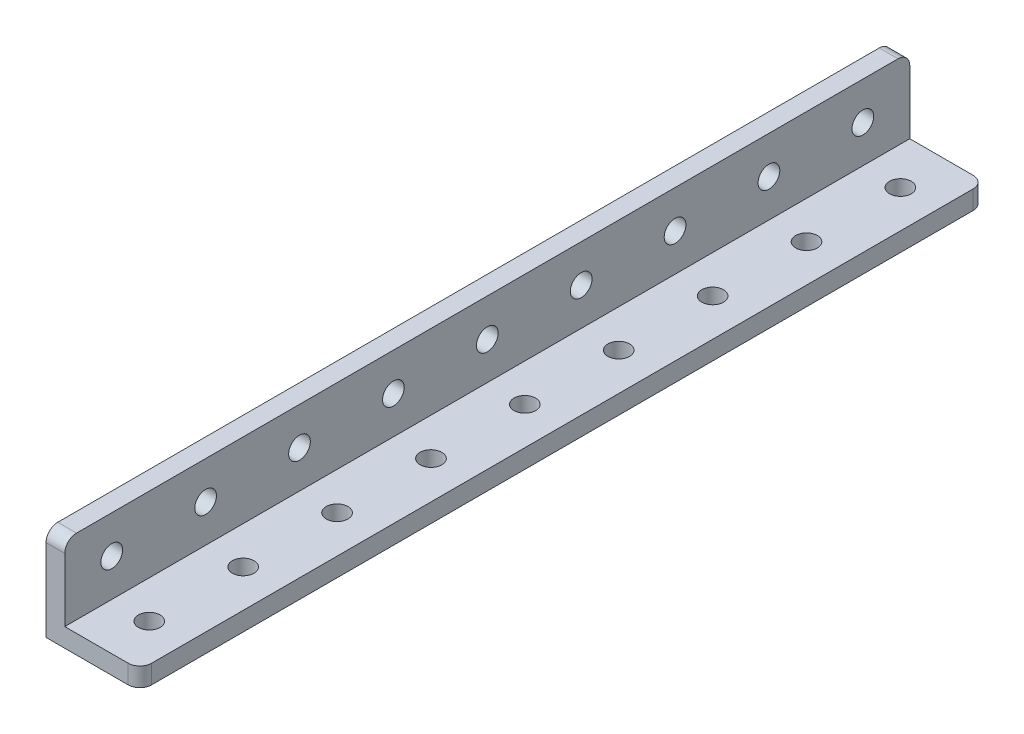
ISO-10303-21;
HEADER;
FILE_DESCRIPTION(('STEP AP214'),'2;1');
FILE_NAME('part.step','',(''),(''),'','','');
FILE_SCHEMA(('AUTOMOTIVE_DESIGN { 1 0 10303 214 1 1 1 1 }'));
ENDSEC;
DATA;
#1=APPLICATION_CONTEXT('core data for automotive mechanical design processes');
#2=APPLICATION_PROTOCOL_DEFINITION('international standard','automotive_design',2000,#1);
#3=PRODUCT_CONTEXT('',#1,'mechanical');
#4=PRODUCT('Part','Part','',(#3));
#5=PRODUCT_RELATED_PRODUCT_CATEGORY('part','',(#4));
#6=PRODUCT_DEFINITION_FORMATION('','',#4);
#7=PRODUCT_DEFINITION_CONTEXT('part definition',#1,'design');
#8=PRODUCT_DEFINITION('design','',#6,#7);
#9=PRODUCT_DEFINITION_SHAPE('','',#8);
#10=(LENGTH_UNIT() NAMED_UNIT(*) SI_UNIT(.MILLI.,.METRE.));
#11=(NAMED_UNIT(*) PLANE_ANGLE_UNIT() SI_UNIT($,.RADIAN.));
#12=(NAMED_UNIT(*) SI_UNIT($,.STERADIAN.) SOLID_ANGLE_UNIT());
#13=UNCERTAINTY_MEASURE_WITH_UNIT(LENGTH_MEASURE(1.E-05),#10,'distance_accuracy_value','');
#14=(GEOMETRIC_REPRESENTATION_CONTEXT(3) GLOBAL_UNCERTAINTY_ASSIGNED_CONTEXT((#13)) GLOBAL_UNIT_ASSIGNED_CONTEXT((#10,
#11,#12)) REPRESENTATION_CONTEXT('',''));
#15=CARTESIAN_POINT('',(0.,0.,0.));
#16=DIRECTION('',(0.,0.,1.));
#17=DIRECTION('',(1.,0.,0.));
#18=AXIS2_PLACEMENT_3D('',#15,#16,#17);
#19=CARTESIAN_POINT('',(0.,16.,-72.));
#20=DIRECTION('',(-1.,0.,0.));
#21=DIRECTION('',(0.,-1.,0.));
#22=AXIS2_PLACEMENT_3D('',#19,#20,#21);
#23=PLANE('',#22);
#24=CARTESIAN_POINT('',(0.,9.6,64.));
#25=DIRECTION('',(-1.,0.,0.));
#26=DIRECTION('',(0.,-1.,0.));
#27=AXIS2_PLACEMENT_3D('',#24,#25,#26);
#28=CIRCLE('',#27,1.85);
#29=CARTESIAN_POINT('',(0.,7.75,64.));
#30=VERTEX_POINT('',#29);
#31=EDGE_CURVE('E230',#30,#30,#28,.T.);
#32=ORIENTED_EDGE('',*,*,#31,.F.);
#33=EDGE_LOOP('',(#32));
#34=FACE_BOUND('',#33,.T.);
#35=CARTESIAN_POINT('',(0.,9.6,48.));
#36=DIRECTION('',(-1.,0.,0.));
#37=DIRECTION('',(0.,-1.,0.));
#38=AXIS2_PLACEMENT_3D('',#35,#36,#37);
#39=CIRCLE('',#38,1.85);
#40=CARTESIAN_POINT('',(0.,7.75,48.));
#41=VERTEX_POINT('',#40);
#42=EDGE_CURVE('E220',#41,#41,#39,.T.);
#43=ORIENTED_EDGE('',*,*,#42,.F.);
#44=EDGE_LOOP('',(#43));
#45=FACE_BOUND('',#44,.T.);
#46=CARTESIAN_POINT('',(0.,9.6,32.));
#47=DIRECTION('',(-1.,0.,0.));
#48=DIRECTION('',(0.,-1.,0.));
#49=AXIS2_PLACEMENT_3D('',#46,#47,#48);
#50=CIRCLE('',#49,1.85);
#51=CARTESIAN_POINT('',(0.,7.75,32.));
#52=VERTEX_POINT('',#51);
#53=EDGE_CURVE('E217',#52,#52,#50,.T.);
#54=ORIENTED_EDGE('',*,*,#53,.F.);
#55=EDGE_LOOP('',(#54));
#56=FACE_BOUND('',#55,.T.);
#57=CARTESIAN_POINT('',(0.,9.6,16.));
#58=DIRECTION('',(-1.,0.,0.));
#59=DIRECTION('',(0.,-1.,0.));
#60=AXIS2_PLACEMENT_3D('',#57,#58,#59);
#61=CIRCLE('',#60,1.85);
#62=CARTESIAN_POINT('',(0.,7.75,16.));
#63=VERTEX_POINT('',#62);
#64=EDGE_CURVE('E214',#63,#63,#61,.T.);
#65=ORIENTED_EDGE('',*,*,#64,.F.);
#66=EDGE_LOOP('',(#65));
#67=FACE_BOUND('',#66,.T.);
#68=CARTESIAN_POINT('',(0.,9.6,-64.));
#69=DIRECTION('',(-1.,0.,0.));
#70=DIRECTION('',(0.,-1.,0.));
#71=AXIS2_PLACEMENT_3D('',#68,#69,#70);
#72=CIRCLE('',#71,1.85);
#73=CARTESIAN_POINT('',(0.,7.75,-64.));
#74=VERTEX_POINT('',#73);
#75=EDGE_CURVE('E210',#74,#74,#72,.T.);
#76=ORIENTED_EDGE('',*,*,#75,.F.);
#77=EDGE_LOOP('',(#76));
#78=FACE_BOUND('',#77,.T.);
#79=CARTESIAN_POINT('',(0.,9.6,-48.));
#80=DIRECTION('',(-1.,0.,0.));
#81=DIRECTION('',(0.,-1.,0.));
#82=AXIS2_PLACEMENT_3D('',#79,#80,#81);
#83=CIRCLE('',#82,1.85);
#84=CARTESIAN_POINT('',(0.,7.75,-48.));
#85=VERTEX_POINT('',#84);
#86=EDGE_CURVE('E206',#85,#85,#83,.T.);
#87=ORIENTED_EDGE('',*,*,#86,.F.);
#88=EDGE_LOOP('',(#87));
#89=FACE_BOUND('',#88,.T.);
#90=CARTESIAN_POINT('',(0.,9.6,-32.));
#91=DIRECTION('',(-1.,0.,0.));
#92=DIRECTION('',(0.,-1.,0.));
#93=AXIS2_PLACEMENT_3D('',#90,#91,#92);
#94=CIRCLE('',#93,1.85);
#95=CARTESIAN_POINT('',(0.,7.75,-32.));
#96=VERTEX_POINT('',#95);
#97=EDGE_CURVE('E202',#96,#96,#94,.T.);
#98=ORIENTED_EDGE('',*,*,#97,.F.);
#99=EDGE_LOOP('',(#98));
#100=FACE_BOUND('',#99,.T.);
#101=CARTESIAN_POINT('',(0.,9.6,-16.));
#102=DIRECTION('',(-1.,0.,0.));
#103=DIRECTION('',(0.,-1.,0.));
#104=AXIS2_PLACEMENT_3D('',#101,#102,#103);
#105=CIRCLE('',#104,1.85);
#106=CARTESIAN_POINT('',(0.,7.75,-16.));
#107=VERTEX_POINT('',#106);
#108=EDGE_CURVE('E198',#107,#107,#105,.T.);
#109=ORIENTED_EDGE('',*,*,#108,.F.);
#110=EDGE_LOOP('',(#109));
#111=FACE_BOUND('',#110,.T.);
#112=CARTESIAN_POINT('',(0.,9.6,0.));
#113=DIRECTION('',(-1.,0.,0.));
#114=DIRECTION('',(0.,-1.,0.));
#115=AXIS2_PLACEMENT_3D('',#112,#113,#114);
#116=CIRCLE('',#115,1.85);
#117=CARTESIAN_POINT('',(0.,7.75,0.));
#118=VERTEX_POINT('',#117);
#119=EDGE_CURVE('E193',#118,#118,#116,.T.);
#120=ORIENTED_EDGE('',*,*,#119,.F.);
#121=EDGE_LOOP('',(#120));
#122=FACE_BOUND('',#121,.T.);
#123=DIRECTION('',(0.,0.,1.));
#124=VECTOR('',#123,1.);
#125=CARTESIAN_POINT('',(0.,16.,-72.));
#126=LINE('',#125,#124);
#127=CARTESIAN_POINT('',(0.,16.,-70.));
#128=VERTEX_POINT('',#127);
#129=CARTESIAN_POINT('',(0.,16.,70.));
#130=VERTEX_POINT('',#129);
#131=EDGE_CURVE('E150',#128,#130,#126,.T.);
#132=ORIENTED_EDGE('',*,*,#131,.F.);
#133=CARTESIAN_POINT('',(0.,14.,-70.));
#134=DIRECTION('',(-1.,0.,0.));
#135=DIRECTION('',(0.,-1.,0.));
#136=AXIS2_PLACEMENT_3D('',#133,#134,#135);
#137=CIRCLE('',#136,2.);
#138=CARTESIAN_POINT('',(0.,14.,-72.));
#139=VERTEX_POINT('',#138);
#140=EDGE_CURVE('E117',#128,#139,#137,.T.);
#141=ORIENTED_EDGE('',*,*,#140,.T.);
#142=DIRECTION('',(0.,-1.,0.));
#143=VECTOR('',#142,1.);
#144=CARTESIAN_POINT('',(0.,16.,-72.));
#145=LINE('',#144,#143);
#146=CARTESIAN_POINT('',(0.,0.,-72.));
#147=VERTEX_POINT('',#146);
#148=EDGE_CURVE('E112',#139,#147,#145,.T.);
#149=ORIENTED_EDGE('',*,*,#148,.T.);
#150=DIRECTION('',(0.,0.,1.));
#151=VECTOR('',#150,1.);
#152=CARTESIAN_POINT('',(0.,0.,-72.));
#153=LINE('',#152,#151);
#154=CARTESIAN_POINT('',(0.,0.,72.));
#155=VERTEX_POINT('',#154);
#156=EDGE_CURVE('E116',#147,#155,#153,.T.);
#157=ORIENTED_EDGE('',*,*,#156,.T.);
#158=DIRECTION('',(0.,-1.,0.));
#159=VECTOR('',#158,1.);
#160=CARTESIAN_POINT('',(0.,16.,72.));
#161=LINE('',#160,#159);
#162=CARTESIAN_POINT('',(0.,14.,72.));
#163=VERTEX_POINT('',#162);
#164=EDGE_CURVE('E142',#163,#155,#161,.T.);
#165=ORIENTED_EDGE('',*,*,#164,.F.);
#166=CARTESIAN_POINT('',(0.,14.,70.));
#167=DIRECTION('',(-1.,0.,0.));
#168=DIRECTION('',(0.,-1.,0.));
#169=AXIS2_PLACEMENT_3D('',#166,#167,#168);
#170=CIRCLE('',#169,2.);
#171=EDGE_CURVE('E168',#163,#130,#170,.T.);
#172=ORIENTED_EDGE('',*,*,#171,.T.);
#173=EDGE_LOOP('',(#132,#141,#149,#157,#165,#172));
#174=FACE_BOUND('',#173,.T.);
#175=ADVANCED_FACE('F31',(#34,#45,#56,#67,#78,#89,#100,#111,#122,#174),#23,.T.);
#176=CARTESIAN_POINT('',(3.2,16.,-72.));
#177=DIRECTION('',(0.,1.,0.));
#178=DIRECTION('',(0.,0.,1.));
#179=AXIS2_PLACEMENT_3D('',#176,#177,#178);
#180=PLANE('',#179);
#181=DIRECTION('',(0.,0.,1.));
#182=VECTOR('',#181,1.);
#183=CARTESIAN_POINT('',(3.2,16.,-72.));
#184=LINE('',#183,#182);
#185=CARTESIAN_POINT('',(3.2,16.,-70.));
#186=VERTEX_POINT('',#185);
#187=CARTESIAN_POINT('',(3.2,16.,70.));
#188=VERTEX_POINT('',#187);
#189=EDGE_CURVE('E154',#186,#188,#184,.T.);
#190=ORIENTED_EDGE('',*,*,#189,.F.);
#191=DIRECTION('',(-1.,0.,0.));
#192=VECTOR('',#191,1.);
#193=CARTESIAN_POINT('',(3.2,16.,-70.));
#194=LINE('',#193,#192);
#195=EDGE_CURVE('E165',#186,#128,#194,.T.);
#196=ORIENTED_EDGE('',*,*,#195,.T.);
#197=ORIENTED_EDGE('',*,*,#131,.T.);
#198=DIRECTION('',(-1.,0.,0.));
#199=VECTOR('',#198,1.);
#200=CARTESIAN_POINT('',(3.2,16.,70.));
#201=LINE('',#200,#199);
#202=EDGE_CURVE('E153',#130,#188,#201,.F.);
#203=ORIENTED_EDGE('',*,*,#202,.T.);
#204=EDGE_LOOP('',(#190,#196,#197,#203));
#205=FACE_BOUND('',#204,.T.);
#206=ADVANCED_FACE('F254',(#205),#180,.T.);
#207=CARTESIAN_POINT('',(3.2,3.2,-72.));
#208=DIRECTION('',(1.,0.,0.));
#209=DIRECTION('',(0.,0.,-1.));
#210=AXIS2_PLACEMENT_3D('',#207,#208,#209);
#211=PLANE('',#210);
#212=CARTESIAN_POINT('',(3.2,9.6,64.));
#213=DIRECTION('',(1.,0.,0.));
#214=DIRECTION('',(0.,0.,-1.));
#215=AXIS2_PLACEMENT_3D('',#212,#213,#214);
#216=CIRCLE('',#215,1.85);
#217=CARTESIAN_POINT('',(3.2,9.6,62.15));
#218=VERTEX_POINT('',#217);
#219=EDGE_CURVE('E35',#218,#218,#216,.T.);
#220=ORIENTED_EDGE('',*,*,#219,.F.);
#221=EDGE_LOOP('',(#220));
#222=FACE_BOUND('',#221,.T.);
#223=CARTESIAN_POINT('',(3.2,9.6,48.));
#224=DIRECTION('',(1.,0.,0.));
#225=DIRECTION('',(0.,0.,-1.));
#226=AXIS2_PLACEMENT_3D('',#223,#224,#225);
#227=CIRCLE('',#226,1.85);
#228=CARTESIAN_POINT('',(3.2,9.6,46.15));
#229=VERTEX_POINT('',#228);
#230=EDGE_CURVE('E218',#229,#229,#227,.T.);
#231=ORIENTED_EDGE('',*,*,#230,.F.);
#232=EDGE_LOOP('',(#231));
#233=FACE_BOUND('',#232,.T.);
#234=CARTESIAN_POINT('',(3.2,9.6,32.));
#235=DIRECTION('',(1.,0.,0.));
#236=DIRECTION('',(0.,0.,-1.));
#237=AXIS2_PLACEMENT_3D('',#234,#235,#236);
#238=CIRCLE('',#237,1.85);
#239=CARTESIAN_POINT('',(3.2,9.6,30.15));
#240=VERTEX_POINT('',#239);
#241=EDGE_CURVE('E215',#240,#240,#238,.T.);
#242=ORIENTED_EDGE('',*,*,#241,.F.);
#243=EDGE_LOOP('',(#242));
#244=FACE_BOUND('',#243,.T.);
#245=CARTESIAN_POINT('',(3.2,9.6,16.));
#246=DIRECTION('',(1.,0.,0.));
#247=DIRECTION('',(0.,0.,-1.));
#248=AXIS2_PLACEMENT_3D('',#245,#246,#247);
#249=CIRCLE('',#248,1.85);
#250=CARTESIAN_POINT('',(3.2,9.6,14.15));
#251=VERTEX_POINT('',#250);
#252=EDGE_CURVE('E211',#251,#251,#249,.T.);
#253=ORIENTED_EDGE('',*,*,#252,.F.);
#254=EDGE_LOOP('',(#253));
#255=FACE_BOUND('',#254,.T.);
#256=CARTESIAN_POINT('',(3.2,9.6,-64.));
#257=DIRECTION('',(1.,0.,0.));
#258=DIRECTION('',(0.,0.,-1.));
#259=AXIS2_PLACEMENT_3D('',#256,#257,#258);
#260=CIRCLE('',#259,1.85);
#261=CARTESIAN_POINT('',(3.2,9.6,-65.85));
#262=VERTEX_POINT('',#261);
#263=EDGE_CURVE('E207',#262,#262,#260,.T.);
#264=ORIENTED_EDGE('',*,*,#263,.F.);
#265=EDGE_LOOP('',(#264));
#266=FACE_BOUND('',#265,.T.);
#267=CARTESIAN_POINT('',(3.2,9.6,-48.));
#268=DIRECTION('',(1.,0.,0.));
#269=DIRECTION('',(0.,0.,-1.));
#270=AXIS2_PLACEMENT_3D('',#267,#268,#269);
#271=CIRCLE('',#270,1.85);
#272=CARTESIAN_POINT('',(3.2,9.6,-49.85));
#273=VERTEX_POINT('',#272);
#274=EDGE_CURVE('E203',#273,#273,#271,.T.);
#275=ORIENTED_EDGE('',*,*,#274,.F.);
#276=EDGE_LOOP('',(#275));
#277=FACE_BOUND('',#276,.T.);
#278=CARTESIAN_POINT('',(3.2,9.6,-32.));
#279=DIRECTION('',(1.,0.,0.));
#280=DIRECTION('',(0.,0.,-1.));
#281=AXIS2_PLACEMENT_3D('',#278,#279,#280);
#282=CIRCLE('',#281,1.85);
#283=CARTESIAN_POINT('',(3.2,9.6,-33.85));
#284=VERTEX_POINT('',#283);
#285=EDGE_CURVE('E199',#284,#284,#282,.T.);
#286=ORIENTED_EDGE('',*,*,#285,.F.);
#287=EDGE_LOOP('',(#286));
#288=FACE_BOUND('',#287,.T.);
#289=CARTESIAN_POINT('',(3.2,9.6,-16.));
#290=DIRECTION('',(1.,0.,0.));
#291=DIRECTION('',(0.,0.,-1.));
#292=AXIS2_PLACEMENT_3D('',#289,#290,#291);
#293=CIRCLE('',#292,1.85);
#294=CARTESIAN_POINT('',(3.2,9.6,-17.85));
#295=VERTEX_POINT('',#294);
#296=EDGE_CURVE('E194',#295,#295,#293,.T.);
#297=ORIENTED_EDGE('',*,*,#296,.F.);
#298=EDGE_LOOP('',(#297));
#299=FACE_BOUND('',#298,.T.);
#300=CARTESIAN_POINT('',(3.2,9.6,0.));
#301=DIRECTION('',(1.,0.,0.));
#302=DIRECTION('',(0.,0.,-1.));
#303=AXIS2_PLACEMENT_3D('',#300,#301,#302);
#304=CIRCLE('',#303,1.85);
#305=CARTESIAN_POINT('',(3.2,9.6,-1.85));
#306=VERTEX_POINT('',#305);
#307=EDGE_CURVE('E144',#306,#306,#304,.T.);
#308=ORIENTED_EDGE('',*,*,#307,.F.);
#309=EDGE_LOOP('',(#308));
#310=FACE_BOUND('',#309,.T.);
#311=DIRECTION('',(0.,1.,0.));
#312=VECTOR('',#311,1.);
#313=CARTESIAN_POINT('',(3.2,3.2,-72.));
#314=LINE('',#313,#312);
#315=CARTESIAN_POINT('',(3.2,3.2,-72.));
#316=VERTEX_POINT('',#315);
#317=CARTESIAN_POINT('',(3.2,14.,-72.));
#318=VERTEX_POINT('',#317);
#319=EDGE_CURVE('E129',#316,#318,#314,.T.);
#320=ORIENTED_EDGE('',*,*,#319,.T.);
#321=CARTESIAN_POINT('',(3.2,14.,-70.));
#322=DIRECTION('',(1.,0.,0.));
#323=DIRECTION('',(0.,0.,-1.));
#324=AXIS2_PLACEMENT_3D('',#321,#322,#323);
#325=CIRCLE('',#324,2.);
#326=EDGE_CURVE('E176',#318,#186,#325,.T.);
#327=ORIENTED_EDGE('',*,*,#326,.T.);
#328=ORIENTED_EDGE('',*,*,#189,.T.);
#329=CARTESIAN_POINT('',(3.2,14.,70.));
#330=DIRECTION('',(1.,0.,0.));
#331=DIRECTION('',(0.,0.,-1.));
#332=AXIS2_PLACEMENT_3D('',#329,#330,#331);
#333=CIRCLE('',#332,2.);
#334=CARTESIAN_POINT('',(3.2,14.,72.));
#335=VERTEX_POINT('',#334);
#336=EDGE_CURVE('E174',#188,#335,#333,.T.);
#337=ORIENTED_EDGE('',*,*,#336,.T.);
#338=DIRECTION('',(0.,1.,0.));
#339=VECTOR('',#338,1.);
#340=CARTESIAN_POINT('',(3.2,3.2,72.));
#341=LINE('',#340,#339);
#342=CARTESIAN_POINT('',(3.2,3.2,72.));
#343=VERTEX_POINT('',#342);
#344=EDGE_CURVE('E122',#343,#335,#341,.T.);
#345=ORIENTED_EDGE('',*,*,#344,.F.);
#346=DIRECTION('',(0.,0.,1.));
#347=VECTOR('',#346,1.);
#348=CARTESIAN_POINT('',(3.2,3.2,-72.));
#349=LINE('',#348,#347);
#350=EDGE_CURVE('E157',#316,#343,#349,.T.);
#351=ORIENTED_EDGE('',*,*,#350,.F.);
#352=EDGE_LOOP('',(#320,#327,#328,#337,#345,#351));
#353=FACE_BOUND('',#352,.T.);
#354=ADVANCED_FACE('F260',(#222,#233,#244,#255,#266,#277,#288,#299,#310,#353),#211,.T.);
#355=CARTESIAN_POINT('',(16.,3.2,-72.));
#356=DIRECTION('',(0.,1.,0.));
#357=DIRECTION('',(-1.,0.,0.));
#358=AXIS2_PLACEMENT_3D('',#355,#356,#357);
#359=PLANE('',#358);
#360=CARTESIAN_POINT('',(9.6,3.2,64.));
#361=DIRECTION('',(0.,1.,0.));
#362=DIRECTION('',(-1.,0.,0.));
#363=AXIS2_PLACEMENT_3D('',#360,#361,#362);
#364=CIRCLE('',#363,1.85);
#365=CARTESIAN_POINT('',(7.75,3.2,64.));
#366=VERTEX_POINT('',#365);
#367=EDGE_CURVE('E391',#366,#366,#364,.T.);
#368=ORIENTED_EDGE('',*,*,#367,.F.);
#369=EDGE_LOOP('',(#368));
#370=FACE_BOUND('',#369,.T.);
#371=CARTESIAN_POINT('',(9.6,3.2,48.));
#372=DIRECTION('',(0.,1.,0.));
#373=DIRECTION('',(-1.,0.,0.));
#374=AXIS2_PLACEMENT_3D('',#371,#372,#373);
#375=CIRCLE('',#374,1.85);
#376=CARTESIAN_POINT('',(7.75,3.2,48.));
#377=VERTEX_POINT('',#376);
#378=EDGE_CURVE('E401',#377,#377,#375,.T.);
#379=ORIENTED_EDGE('',*,*,#378,.F.);
#380=EDGE_LOOP('',(#379));
#381=FACE_BOUND('',#380,.T.);
#382=CARTESIAN_POINT('',(9.6,3.2,32.));
#383=DIRECTION('',(0.,1.,0.));
#384=DIRECTION('',(-1.,0.,0.));
#385=AXIS2_PLACEMENT_3D('',#382,#383,#384);
#386=CIRCLE('',#385,1.85);
#387=CARTESIAN_POINT('',(7.75,3.2,32.));
#388=VERTEX_POINT('',#387);
#389=EDGE_CURVE('E407',#388,#388,#386,.T.);
#390=ORIENTED_EDGE('',*,*,#389,.F.);
#391=EDGE_LOOP('',(#390));
#392=FACE_BOUND('',#391,.T.);
#393=CARTESIAN_POINT('',(9.6,3.2,16.));
#394=DIRECTION('',(0.,1.,0.));
#395=DIRECTION('',(-1.,0.,0.));
#396=AXIS2_PLACEMENT_3D('',#393,#394,#395);
#397=CIRCLE('',#396,1.85);
#398=CARTESIAN_POINT('',(7.75,3.2,16.));
#399=VERTEX_POINT('',#398);
#400=EDGE_CURVE('E413',#399,#399,#397,.T.);
#401=ORIENTED_EDGE('',*,*,#400,.F.);
#402=EDGE_LOOP('',(#401));
#403=FACE_BOUND('',#402,.T.);
#404=CARTESIAN_POINT('',(9.6,3.2,-64.));
#405=DIRECTION('',(0.,1.,0.));
#406=DIRECTION('',(-1.,0.,0.));
#407=AXIS2_PLACEMENT_3D('',#404,#405,#406);
#408=CIRCLE('',#407,1.85);
#409=CARTESIAN_POINT('',(7.75,3.2,-64.));
#410=VERTEX_POINT('',#409);
#411=EDGE_CURVE('E419',#410,#410,#408,.T.);
#412=ORIENTED_EDGE('',*,*,#411,.F.);
#413=EDGE_LOOP('',(#412));
#414=FACE_BOUND('',#413,.T.);
#415=CARTESIAN_POINT('',(9.6,3.2,-48.));
#416=DIRECTION('',(0.,1.,0.));
#417=DIRECTION('',(-1.,0.,0.));
#418=AXIS2_PLACEMENT_3D('',#415,#416,#417);
#419=CIRCLE('',#418,1.85);
#420=CARTESIAN_POINT('',(7.75,3.2,-48.));
#421=VERTEX_POINT('',#420);
#422=EDGE_CURVE('E425',#421,#421,#419,.T.);
#423=ORIENTED_EDGE('',*,*,#422,.F.);
#424=EDGE_LOOP('',(#423));
#425=FACE_BOUND('',#424,.T.);
#426=CARTESIAN_POINT('',(9.6,3.2,-32.));
#427=DIRECTION('',(0.,1.,0.));
#428=DIRECTION('',(-1.,0.,0.));
#429=AXIS2_PLACEMENT_3D('',#426,#427,#428);
#430=CIRCLE('',#429,1.85);
#431=CARTESIAN_POINT('',(7.75,3.2,-32.));
#432=VERTEX_POINT('',#431);
#433=EDGE_CURVE('E431',#432,#432,#430,.T.);
#434=ORIENTED_EDGE('',*,*,#433,.F.);
#435=EDGE_LOOP('',(#434));
#436=FACE_BOUND('',#435,.T.);
#437=CARTESIAN_POINT('',(9.6,3.2,-16.));
#438=DIRECTION('',(0.,1.,0.));
#439=DIRECTION('',(-1.,0.,0.));
#440=AXIS2_PLACEMENT_3D('',#437,#438,#439);
#441=CIRCLE('',#440,1.85);
#442=CARTESIAN_POINT('',(7.75,3.2,-16.));
#443=VERTEX_POINT('',#442);
#444=EDGE_CURVE('E436',#443,#443,#441,.T.);
#445=ORIENTED_EDGE('',*,*,#444,.F.);
#446=EDGE_LOOP('',(#445));
#447=FACE_BOUND('',#446,.T.);
#448=CARTESIAN_POINT('',(9.6,3.2,0.));
#449=DIRECTION('',(0.,1.,0.));
#450=DIRECTION('',(-1.,0.,0.));
#451=AXIS2_PLACEMENT_3D('',#448,#449,#450);
#452=CIRCLE('',#451,1.85);
#453=CARTESIAN_POINT('',(7.75,3.2,0.));
#454=VERTEX_POINT('',#453);
#455=EDGE_CURVE('E246',#454,#454,#452,.T.);
#456=ORIENTED_EDGE('',*,*,#455,.F.);
#457=EDGE_LOOP('',(#456));
#458=FACE_BOUND('',#457,.T.);
#459=DIRECTION('',(0.,0.,1.));
#460=VECTOR('',#459,1.);
#461=CARTESIAN_POINT('',(16.,3.2,-72.));
#462=LINE('',#461,#460);
#463=CARTESIAN_POINT('',(16.,3.2,-70.));
#464=VERTEX_POINT('',#463);
#465=CARTESIAN_POINT('',(16.,3.2,70.));
#466=VERTEX_POINT('',#465);
#467=EDGE_CURVE('E160',#464,#466,#462,.T.);
#468=ORIENTED_EDGE('',*,*,#467,.F.);
#469=CARTESIAN_POINT('',(14.,3.2,-70.));
#470=DIRECTION('',(0.,1.,0.));
#471=DIRECTION('',(-1.,0.,0.));
#472=AXIS2_PLACEMENT_3D('',#469,#470,#471);
#473=CIRCLE('',#472,2.);
#474=CARTESIAN_POINT('',(14.,3.2,-72.));
#475=VERTEX_POINT('',#474);
#476=EDGE_CURVE('E184',#464,#475,#473,.T.);
#477=ORIENTED_EDGE('',*,*,#476,.T.);
#478=DIRECTION('',(-1.,0.,0.));
#479=VECTOR('',#478,1.);
#480=CARTESIAN_POINT('',(16.,3.2,-72.));
#481=LINE('',#480,#479);
#482=EDGE_CURVE('E135',#475,#316,#481,.T.);
#483=ORIENTED_EDGE('',*,*,#482,.T.);
#484=ORIENTED_EDGE('',*,*,#350,.T.);
#485=DIRECTION('',(-1.,0.,0.));
#486=VECTOR('',#485,1.);
#487=CARTESIAN_POINT('',(16.,3.2,72.));
#488=LINE('',#487,#486);
#489=CARTESIAN_POINT('',(14.,3.2,72.));
#490=VERTEX_POINT('',#489);
#491=EDGE_CURVE('E146',#490,#343,#488,.T.);
#492=ORIENTED_EDGE('',*,*,#491,.F.);
#493=CARTESIAN_POINT('',(14.,3.2,70.));
#494=DIRECTION('',(0.,1.,0.));
#495=DIRECTION('',(-1.,0.,0.));
#496=AXIS2_PLACEMENT_3D('',#493,#494,#495);
#497=CIRCLE('',#496,2.);
#498=EDGE_CURVE('E56',#490,#466,#497,.T.);
#499=ORIENTED_EDGE('',*,*,#498,.T.);
#500=EDGE_LOOP('',(#468,#477,#483,#484,#492,#499));
#501=FACE_BOUND('',#500,.T.);
#502=ADVANCED_FACE('F286',(#370,#381,#392,#403,#414,#425,#436,#447,#458,#501),#359,.T.);
#503=CARTESIAN_POINT('',(16.,0.,-72.));
#504=DIRECTION('',(1.,0.,0.));
#505=DIRECTION('',(0.,0.,-1.));
#506=AXIS2_PLACEMENT_3D('',#503,#504,#505);
#507=PLANE('',#506);
#508=DIRECTION('',(0.,0.,1.));
#509=VECTOR('',#508,1.);
#510=CARTESIAN_POINT('',(16.,0.,-72.));
#511=LINE('',#510,#509);
#512=CARTESIAN_POINT('',(16.,0.,-70.));
#513=VERTEX_POINT('',#512);
#514=CARTESIAN_POINT('',(16.,0.,70.));
#515=VERTEX_POINT('',#514);
#516=EDGE_CURVE('E128',#513,#515,#511,.T.);
#517=ORIENTED_EDGE('',*,*,#516,.F.);
#518=DIRECTION('',(0.,1.,0.));
#519=VECTOR('',#518,1.);
#520=CARTESIAN_POINT('',(16.,0.,-70.));
#521=LINE('',#520,#519);
#522=EDGE_CURVE('E180',#513,#464,#521,.T.);
#523=ORIENTED_EDGE('',*,*,#522,.T.);
#524=ORIENTED_EDGE('',*,*,#467,.T.);
#525=DIRECTION('',(0.,1.,0.));
#526=VECTOR('',#525,1.);
#527=CARTESIAN_POINT('',(16.,0.,70.));
#528=LINE('',#527,#526);
#529=EDGE_CURVE('E178',#466,#515,#528,.F.);
#530=ORIENTED_EDGE('',*,*,#529,.T.);
#531=EDGE_LOOP('',(#517,#523,#524,#530));
#532=FACE_BOUND('',#531,.T.);
#533=ADVANCED_FACE('F300',(#532),#507,.T.);
#534=CARTESIAN_POINT('',(0.,0.,-72.));
#535=DIRECTION('',(0.,-1.,0.));
#536=DIRECTION('',(0.,0.,-1.));
#537=AXIS2_PLACEMENT_3D('',#534,#535,#536);
#538=PLANE('',#537);
#539=CARTESIAN_POINT('',(9.6,0.,64.));
#540=DIRECTION('',(0.,-1.,0.));
#541=DIRECTION('',(0.,0.,-1.));
#542=AXIS2_PLACEMENT_3D('',#539,#540,#541);
#543=CIRCLE('',#542,1.85);
#544=CARTESIAN_POINT('',(9.6,0.,62.15));
#545=VERTEX_POINT('',#544);
#546=EDGE_CURVE('E394',#545,#545,#543,.T.);
#547=ORIENTED_EDGE('',*,*,#546,.F.);
#548=EDGE_LOOP('',(#547));
#549=FACE_BOUND('',#548,.T.);
#550=CARTESIAN_POINT('',(9.6,0.,48.));
#551=DIRECTION('',(0.,-1.,0.));
#552=DIRECTION('',(0.,0.,-1.));
#553=AXIS2_PLACEMENT_3D('',#550,#551,#552);
#554=CIRCLE('',#553,1.85);
#555=CARTESIAN_POINT('',(9.6,0.,46.15));
#556=VERTEX_POINT('',#555);
#557=EDGE_CURVE('E396',#556,#556,#554,.T.);
#558=ORIENTED_EDGE('',*,*,#557,.F.);
#559=EDGE_LOOP('',(#558));
#560=FACE_BOUND('',#559,.T.);
#561=CARTESIAN_POINT('',(9.6,0.,32.));
#562=DIRECTION('',(0.,-1.,0.));
#563=DIRECTION('',(0.,0.,-1.));
#564=AXIS2_PLACEMENT_3D('',#561,#562,#563);
#565=CIRCLE('',#564,1.85);
#566=CARTESIAN_POINT('',(9.6,0.,30.15));
#567=VERTEX_POINT('',#566);
#568=EDGE_CURVE('E404',#567,#567,#565,.T.);
#569=ORIENTED_EDGE('',*,*,#568,.F.);
#570=EDGE_LOOP('',(#569));
#571=FACE_BOUND('',#570,.T.);
#572=CARTESIAN_POINT('',(9.6,0.,16.));
#573=DIRECTION('',(0.,-1.,0.));
#574=DIRECTION('',(0.,0.,-1.));
#575=AXIS2_PLACEMENT_3D('',#572,#573,#574);
#576=CIRCLE('',#575,1.85);
#577=CARTESIAN_POINT('',(9.6,0.,14.15));
#578=VERTEX_POINT('',#577);
#579=EDGE_CURVE('E410',#578,#578,#576,.T.);
#580=ORIENTED_EDGE('',*,*,#579,.F.);
#581=EDGE_LOOP('',(#580));
#582=FACE_BOUND('',#581,.T.);
#583=CARTESIAN_POINT('',(9.6,0.,-64.));
#584=DIRECTION('',(0.,-1.,0.));
#585=DIRECTION('',(0.,0.,-1.));
#586=AXIS2_PLACEMENT_3D('',#583,#584,#585);
#587=CIRCLE('',#586,1.85);
#588=CARTESIAN_POINT('',(9.6,0.,-65.85));
#589=VERTEX_POINT('',#588);
#590=EDGE_CURVE('E416',#589,#589,#587,.T.);
#591=ORIENTED_EDGE('',*,*,#590,.F.);
#592=EDGE_LOOP('',(#591));
#593=FACE_BOUND('',#592,.T.);
#594=CARTESIAN_POINT('',(9.6,0.,-48.));
#595=DIRECTION('',(0.,-1.,0.));
#596=DIRECTION('',(0.,0.,-1.));
#597=AXIS2_PLACEMENT_3D('',#594,#595,#596);
#598=CIRCLE('',#597,1.85);
#599=CARTESIAN_POINT('',(9.6,0.,-49.85));
#600=VERTEX_POINT('',#599);
#601=EDGE_CURVE('E422',#600,#600,#598,.T.);
#602=ORIENTED_EDGE('',*,*,#601,.F.);
#603=EDGE_LOOP('',(#602));
#604=FACE_BOUND('',#603,.T.);
#605=CARTESIAN_POINT('',(9.6,0.,-32.));
#606=DIRECTION('',(0.,-1.,0.));
#607=DIRECTION('',(0.,0.,-1.));
#608=AXIS2_PLACEMENT_3D('',#605,#606,#607);
#609=CIRCLE('',#608,1.85);
#610=CARTESIAN_POINT('',(9.6,0.,-33.85));
#611=VERTEX_POINT('',#610);
#612=EDGE_CURVE('E428',#611,#611,#609,.T.);
#613=ORIENTED_EDGE('',*,*,#612,.F.);
#614=EDGE_LOOP('',(#613));
#615=FACE_BOUND('',#614,.T.);
#616=CARTESIAN_POINT('',(9.6,0.,-16.));
#617=DIRECTION('',(0.,-1.,0.));
#618=DIRECTION('',(0.,0.,-1.));
#619=AXIS2_PLACEMENT_3D('',#616,#617,#618);
#620=CIRCLE('',#619,1.85);
#621=CARTESIAN_POINT('',(9.6,0.,-17.85));
#622=VERTEX_POINT('',#621);
#623=EDGE_CURVE('E434',#622,#622,#620,.T.);
#624=ORIENTED_EDGE('',*,*,#623,.F.);
#625=EDGE_LOOP('',(#624));
#626=FACE_BOUND('',#625,.T.);
#627=CARTESIAN_POINT('',(9.6,0.,0.));
#628=DIRECTION('',(0.,-1.,0.));
#629=DIRECTION('',(0.,0.,-1.));
#630=AXIS2_PLACEMENT_3D('',#627,#628,#629);
#631=CIRCLE('',#630,1.85);
#632=CARTESIAN_POINT('',(9.6,0.,-1.85));
#633=VERTEX_POINT('',#632);
#634=EDGE_CURVE('E197',#633,#633,#631,.T.);
#635=ORIENTED_EDGE('',*,*,#634,.F.);
#636=EDGE_LOOP('',(#635));
#637=FACE_BOUND('',#636,.T.);
#638=DIRECTION('',(1.,0.,0.));
#639=VECTOR('',#638,1.);
#640=CARTESIAN_POINT('',(0.,0.,-72.));
#641=LINE('',#640,#639);
#642=CARTESIAN_POINT('',(14.,0.,-72.));
#643=VERTEX_POINT('',#642);
#644=EDGE_CURVE('E121',#147,#643,#641,.T.);
#645=ORIENTED_EDGE('',*,*,#644,.T.);
#646=CARTESIAN_POINT('',(14.,0.,-70.));
#647=DIRECTION('',(0.,-1.,0.));
#648=DIRECTION('',(0.,0.,-1.));
#649=AXIS2_PLACEMENT_3D('',#646,#647,#648);
#650=CIRCLE('',#649,2.);
#651=EDGE_CURVE('E187',#643,#513,#650,.T.);
#652=ORIENTED_EDGE('',*,*,#651,.T.);
#653=ORIENTED_EDGE('',*,*,#516,.T.);
#654=CARTESIAN_POINT('',(14.,0.,70.));
#655=DIRECTION('',(0.,-1.,0.));
#656=DIRECTION('',(0.,0.,-1.));
#657=AXIS2_PLACEMENT_3D('',#654,#655,#656);
#658=CIRCLE('',#657,2.);
#659=CARTESIAN_POINT('',(14.,0.,72.));
#660=VERTEX_POINT('',#659);
#661=EDGE_CURVE('E48',#515,#660,#658,.T.);
#662=ORIENTED_EDGE('',*,*,#661,.T.);
#663=DIRECTION('',(1.,0.,0.));
#664=VECTOR('',#663,1.);
#665=CARTESIAN_POINT('',(0.,0.,72.));
#666=LINE('',#665,#664);
#667=EDGE_CURVE('E127',#155,#660,#666,.T.);
#668=ORIENTED_EDGE('',*,*,#667,.F.);
#669=ORIENTED_EDGE('',*,*,#156,.F.);
#670=EDGE_LOOP('',(#645,#652,#653,#662,#668,#669));
#671=FACE_BOUND('',#670,.T.);
#672=ADVANCED_FACE('F125',(#549,#560,#571,#582,#593,#604,#615,#626,#637,#671),#538,.T.);
#673=CARTESIAN_POINT('',(0.,16.,-72.));
#674=DIRECTION('',(0.,0.,-1.));
#675=DIRECTION('',(-1.,0.,0.));
#676=AXIS2_PLACEMENT_3D('',#673,#674,#675);
#677=PLANE('',#676);
#678=ORIENTED_EDGE('',*,*,#148,.F.);
#679=DIRECTION('',(-1.,0.,0.));
#680=VECTOR('',#679,1.);
#681=CARTESIAN_POINT('',(0.,14.,-72.));
#682=LINE('',#681,#680);
#683=EDGE_CURVE('E172',#139,#318,#682,.F.);
#684=ORIENTED_EDGE('',*,*,#683,.T.);
#685=ORIENTED_EDGE('',*,*,#319,.F.);
#686=ORIENTED_EDGE('',*,*,#482,.F.);
#687=DIRECTION('',(0.,1.,0.));
#688=VECTOR('',#687,1.);
#689=CARTESIAN_POINT('',(14.,16.,-72.));
#690=LINE('',#689,#688);
#691=EDGE_CURVE('E134',#475,#643,#690,.F.);
#692=ORIENTED_EDGE('',*,*,#691,.T.);
#693=ORIENTED_EDGE('',*,*,#644,.F.);
#694=EDGE_LOOP('',(#678,#684,#685,#686,#692,#693));
#695=FACE_BOUND('',#694,.T.);
#696=ADVANCED_FACE('F131',(#695),#677,.T.);
#697=CARTESIAN_POINT('',(0.,16.,72.));
#698=DIRECTION('',(0.,0.,-1.));
#699=DIRECTION('',(-1.,0.,0.));
#700=AXIS2_PLACEMENT_3D('',#697,#698,#699);
#701=PLANE('',#700);
#702=ORIENTED_EDGE('',*,*,#667,.T.);
#703=DIRECTION('',(0.,1.,0.));
#704=VECTOR('',#703,1.);
#705=CARTESIAN_POINT('',(14.,3.2,72.));
#706=LINE('',#705,#704);
#707=EDGE_CURVE('E11',#660,#490,#706,.T.);
#708=ORIENTED_EDGE('',*,*,#707,.T.);
#709=ORIENTED_EDGE('',*,*,#491,.T.);
#710=ORIENTED_EDGE('',*,*,#344,.T.);
#711=DIRECTION('',(-1.,0.,0.));
#712=VECTOR('',#711,1.);
#713=CARTESIAN_POINT('',(0.,14.,72.));
#714=LINE('',#713,#712);
#715=EDGE_CURVE('E40',#335,#163,#714,.T.);
#716=ORIENTED_EDGE('',*,*,#715,.T.);
#717=ORIENTED_EDGE('',*,*,#164,.T.);
#718=EDGE_LOOP('',(#702,#708,#709,#710,#716,#717));
#719=FACE_BOUND('',#718,.T.);
#720=ADVANCED_FACE('F272',(#719),#701,.F.);
#721=CARTESIAN_POINT('',(3.2,14.,-70.));
#722=DIRECTION('',(-1.,0.,0.));
#723=DIRECTION('',(0.,0.,1.));
#724=AXIS2_PLACEMENT_3D('',#721,#722,#723);
#725=CYLINDRICAL_SURFACE('',#724,2.);
#726=ORIENTED_EDGE('',*,*,#326,.F.);
#727=ORIENTED_EDGE('',*,*,#683,.F.);
#728=ORIENTED_EDGE('',*,*,#140,.F.);
#729=ORIENTED_EDGE('',*,*,#195,.F.);
#730=EDGE_LOOP('',(#726,#727,#728,#729));
#731=FACE_BOUND('',#730,.T.);
#732=ADVANCED_FACE('F268',(#731),#725,.T.);
#733=CARTESIAN_POINT('',(14.,0.,-70.));
#734=DIRECTION('',(0.,1.,0.));
#735=DIRECTION('',(0.,0.,1.));
#736=AXIS2_PLACEMENT_3D('',#733,#734,#735);
#737=CYLINDRICAL_SURFACE('',#736,2.);
#738=ORIENTED_EDGE('',*,*,#651,.F.);
#739=ORIENTED_EDGE('',*,*,#691,.F.);
#740=ORIENTED_EDGE('',*,*,#476,.F.);
#741=ORIENTED_EDGE('',*,*,#522,.F.);
#742=EDGE_LOOP('',(#738,#739,#740,#741));
#743=FACE_BOUND('',#742,.T.);
#744=ADVANCED_FACE('F271',(#743),#737,.T.);
#745=CARTESIAN_POINT('',(14.,16.,70.));
#746=DIRECTION('',(0.,-1.,0.));
#747=DIRECTION('',(0.,0.,-1.));
#748=AXIS2_PLACEMENT_3D('',#745,#746,#747);
#749=CYLINDRICAL_SURFACE('',#748,2.);
#750=ORIENTED_EDGE('',*,*,#661,.F.);
#751=ORIENTED_EDGE('',*,*,#529,.F.);
#752=ORIENTED_EDGE('',*,*,#498,.F.);
#753=ORIENTED_EDGE('',*,*,#707,.F.);
#754=EDGE_LOOP('',(#750,#751,#752,#753));
#755=FACE_BOUND('',#754,.T.);
#756=ADVANCED_FACE('F275',(#755),#749,.T.);
#757=CARTESIAN_POINT('',(0.,14.,70.));
#758=DIRECTION('',(1.,0.,0.));
#759=DIRECTION('',(0.,0.,-1.));
#760=AXIS2_PLACEMENT_3D('',#757,#758,#759);
#761=CYLINDRICAL_SURFACE('',#760,2.);
#762=ORIENTED_EDGE('',*,*,#336,.F.);
#763=ORIENTED_EDGE('',*,*,#202,.F.);
#764=ORIENTED_EDGE('',*,*,#171,.F.);
#765=ORIENTED_EDGE('',*,*,#715,.F.);
#766=EDGE_LOOP('',(#762,#763,#764,#765));
#767=FACE_BOUND('',#766,.T.);
#768=ADVANCED_FACE('F33',(#767),#761,.T.);
#769=CARTESIAN_POINT('',(16.,9.6,0.));
#770=DIRECTION('',(-1.,0.,0.));
#771=DIRECTION('',(0.,-1.,0.));
#772=AXIS2_PLACEMENT_3D('',#769,#770,#771);
#773=CYLINDRICAL_SURFACE('',#772,1.85);
#774=ORIENTED_EDGE('',*,*,#307,.T.);
#775=EDGE_LOOP('',(#774));
#776=FACE_BOUND('',#775,.T.);
#777=ORIENTED_EDGE('',*,*,#119,.T.);
#778=EDGE_LOOP('',(#777));
#779=FACE_BOUND('',#778,.T.);
#780=ADVANCED_FACE('F251',(#776,#779),#773,.F.);
#781=CARTESIAN_POINT('',(9.6,16.,0.));
#782=DIRECTION('',(0.,-1.,0.));
#783=DIRECTION('',(0.,0.,-1.));
#784=AXIS2_PLACEMENT_3D('',#781,#782,#783);
#785=CYLINDRICAL_SURFACE('',#784,1.85);
#786=ORIENTED_EDGE('',*,*,#455,.T.);
#787=EDGE_LOOP('',(#786));
#788=FACE_BOUND('',#787,.T.);
#789=ORIENTED_EDGE('',*,*,#634,.T.);
#790=EDGE_LOOP('',(#789));
#791=FACE_BOUND('',#790,.T.);
#792=ADVANCED_FACE('F319',(#788,#791),#785,.F.);
#793=CARTESIAN_POINT('',(16.,9.6,-16.));
#794=DIRECTION('',(-1.,0.,0.));
#795=DIRECTION('',(0.,-1.,0.));
#796=AXIS2_PLACEMENT_3D('',#793,#794,#795);
#797=CYLINDRICAL_SURFACE('',#796,1.85);
#798=ORIENTED_EDGE('',*,*,#296,.T.);
#799=EDGE_LOOP('',(#798));
#800=FACE_BOUND('',#799,.T.);
#801=ORIENTED_EDGE('',*,*,#108,.T.);
#802=EDGE_LOOP('',(#801));
#803=FACE_BOUND('',#802,.T.);
#804=ADVANCED_FACE('F323',(#800,#803),#797,.F.);
#805=CARTESIAN_POINT('',(16.,9.6,-32.));
#806=DIRECTION('',(-1.,0.,0.));
#807=DIRECTION('',(0.,-1.,0.));
#808=AXIS2_PLACEMENT_3D('',#805,#806,#807);
#809=CYLINDRICAL_SURFACE('',#808,1.85);
#810=ORIENTED_EDGE('',*,*,#285,.T.);
#811=EDGE_LOOP('',(#810));
#812=FACE_BOUND('',#811,.T.);
#813=ORIENTED_EDGE('',*,*,#97,.T.);
#814=EDGE_LOOP('',(#813));
#815=FACE_BOUND('',#814,.T.);
#816=ADVANCED_FACE('F327',(#812,#815),#809,.F.);
#817=CARTESIAN_POINT('',(16.,9.6,-48.));
#818=DIRECTION('',(-1.,0.,0.));
#819=DIRECTION('',(0.,-1.,0.));
#820=AXIS2_PLACEMENT_3D('',#817,#818,#819);
#821=CYLINDRICAL_SURFACE('',#820,1.85);
#822=ORIENTED_EDGE('',*,*,#274,.T.);
#823=EDGE_LOOP('',(#822));
#824=FACE_BOUND('',#823,.T.);
#825=ORIENTED_EDGE('',*,*,#86,.T.);
#826=EDGE_LOOP('',(#825));
#827=FACE_BOUND('',#826,.T.);
#828=ADVANCED_FACE('F331',(#824,#827),#821,.F.);
#829=CARTESIAN_POINT('',(16.,9.6,-64.));
#830=DIRECTION('',(-1.,0.,0.));
#831=DIRECTION('',(0.,-1.,0.));
#832=AXIS2_PLACEMENT_3D('',#829,#830,#831);
#833=CYLINDRICAL_SURFACE('',#832,1.85);
#834=ORIENTED_EDGE('',*,*,#263,.T.);
#835=EDGE_LOOP('',(#834));
#836=FACE_BOUND('',#835,.T.);
#837=ORIENTED_EDGE('',*,*,#75,.T.);
#838=EDGE_LOOP('',(#837));
#839=FACE_BOUND('',#838,.T.);
#840=ADVANCED_FACE('F335',(#836,#839),#833,.F.);
#841=CARTESIAN_POINT('',(16.,9.6,16.));
#842=DIRECTION('',(-1.,0.,0.));
#843=DIRECTION('',(0.,-1.,0.));
#844=AXIS2_PLACEMENT_3D('',#841,#842,#843);
#845=CYLINDRICAL_SURFACE('',#844,1.85);
#846=ORIENTED_EDGE('',*,*,#252,.T.);
#847=EDGE_LOOP('',(#846));
#848=FACE_BOUND('',#847,.T.);
#849=ORIENTED_EDGE('',*,*,#64,.T.);
#850=EDGE_LOOP('',(#849));
#851=FACE_BOUND('',#850,.T.);
#852=ADVANCED_FACE('F339',(#848,#851),#845,.F.);
#853=CARTESIAN_POINT('',(16.,9.6,32.));
#854=DIRECTION('',(-1.,0.,0.));
#855=DIRECTION('',(0.,-1.,0.));
#856=AXIS2_PLACEMENT_3D('',#853,#854,#855);
#857=CYLINDRICAL_SURFACE('',#856,1.85);
#858=ORIENTED_EDGE('',*,*,#241,.T.);
#859=EDGE_LOOP('',(#858));
#860=FACE_BOUND('',#859,.T.);
#861=ORIENTED_EDGE('',*,*,#53,.T.);
#862=EDGE_LOOP('',(#861));
#863=FACE_BOUND('',#862,.T.);
#864=ADVANCED_FACE('F343',(#860,#863),#857,.F.);
#865=CARTESIAN_POINT('',(16.,9.6,48.));
#866=DIRECTION('',(-1.,0.,0.));
#867=DIRECTION('',(0.,-1.,0.));
#868=AXIS2_PLACEMENT_3D('',#865,#866,#867);
#869=CYLINDRICAL_SURFACE('',#868,1.85);
#870=ORIENTED_EDGE('',*,*,#230,.T.);
#871=EDGE_LOOP('',(#870));
#872=FACE_BOUND('',#871,.T.);
#873=ORIENTED_EDGE('',*,*,#42,.T.);
#874=EDGE_LOOP('',(#873));
#875=FACE_BOUND('',#874,.T.);
#876=ADVANCED_FACE('F347',(#872,#875),#869,.F.);
#877=CARTESIAN_POINT('',(16.,9.6,64.));
#878=DIRECTION('',(-1.,0.,0.));
#879=DIRECTION('',(0.,-1.,0.));
#880=AXIS2_PLACEMENT_3D('',#877,#878,#879);
#881=CYLINDRICAL_SURFACE('',#880,1.85);
#882=ORIENTED_EDGE('',*,*,#219,.T.);
#883=EDGE_LOOP('',(#882));
#884=FACE_BOUND('',#883,.T.);
#885=ORIENTED_EDGE('',*,*,#31,.T.);
#886=EDGE_LOOP('',(#885));
#887=FACE_BOUND('',#886,.T.);
#888=ADVANCED_FACE('F351',(#884,#887),#881,.F.);
#889=CARTESIAN_POINT('',(9.6,16.,-16.));
#890=DIRECTION('',(0.,-1.,0.));
#891=DIRECTION('',(0.,0.,-1.));
#892=AXIS2_PLACEMENT_3D('',#889,#890,#891);
#893=CYLINDRICAL_SURFACE('',#892,1.85);
#894=ORIENTED_EDGE('',*,*,#444,.T.);
#895=EDGE_LOOP('',(#894));
#896=FACE_BOUND('',#895,.T.);
#897=ORIENTED_EDGE('',*,*,#623,.T.);
#898=EDGE_LOOP('',(#897));
#899=FACE_BOUND('',#898,.T.);
#900=ADVANCED_FACE('F354',(#896,#899),#893,.F.);
#901=CARTESIAN_POINT('',(9.6,16.,-32.));
#902=DIRECTION('',(0.,-1.,0.));
#903=DIRECTION('',(0.,0.,-1.));
#904=AXIS2_PLACEMENT_3D('',#901,#902,#903);
#905=CYLINDRICAL_SURFACE('',#904,1.85);
#906=ORIENTED_EDGE('',*,*,#433,.T.);
#907=EDGE_LOOP('',(#906));
#908=FACE_BOUND('',#907,.T.);
#909=ORIENTED_EDGE('',*,*,#612,.T.);
#910=EDGE_LOOP('',(#909));
#911=FACE_BOUND('',#910,.T.);
#912=ADVANCED_FACE('F358',(#908,#911),#905,.F.);
#913=CARTESIAN_POINT('',(9.6,16.,-48.));
#914=DIRECTION('',(0.,-1.,0.));
#915=DIRECTION('',(0.,0.,-1.));
#916=AXIS2_PLACEMENT_3D('',#913,#914,#915);
#917=CYLINDRICAL_SURFACE('',#916,1.85);
#918=ORIENTED_EDGE('',*,*,#422,.T.);
#919=EDGE_LOOP('',(#918));
#920=FACE_BOUND('',#919,.T.);
#921=ORIENTED_EDGE('',*,*,#601,.T.);
#922=EDGE_LOOP('',(#921));
#923=FACE_BOUND('',#922,.T.);
#924=ADVANCED_FACE('F362',(#920,#923),#917,.F.);
#925=CARTESIAN_POINT('',(9.6,16.,-64.));
#926=DIRECTION('',(0.,-1.,0.));
#927=DIRECTION('',(0.,0.,-1.));
#928=AXIS2_PLACEMENT_3D('',#925,#926,#927);
#929=CYLINDRICAL_SURFACE('',#928,1.85);
#930=ORIENTED_EDGE('',*,*,#411,.T.);
#931=EDGE_LOOP('',(#930));
#932=FACE_BOUND('',#931,.T.);
#933=ORIENTED_EDGE('',*,*,#590,.T.);
#934=EDGE_LOOP('',(#933));
#935=FACE_BOUND('',#934,.T.);
#936=ADVANCED_FACE('F366',(#932,#935),#929,.F.);
#937=CARTESIAN_POINT('',(9.6,16.,16.));
#938=DIRECTION('',(0.,-1.,0.));
#939=DIRECTION('',(0.,0.,-1.));
#940=AXIS2_PLACEMENT_3D('',#937,#938,#939);
#941=CYLINDRICAL_SURFACE('',#940,1.85);
#942=ORIENTED_EDGE('',*,*,#400,.T.);
#943=EDGE_LOOP('',(#942));
#944=FACE_BOUND('',#943,.T.);
#945=ORIENTED_EDGE('',*,*,#579,.T.);
#946=EDGE_LOOP('',(#945));
#947=FACE_BOUND('',#946,.T.);
#948=ADVANCED_FACE('F370',(#944,#947),#941,.F.);
#949=CARTESIAN_POINT('',(9.6,16.,32.));
#950=DIRECTION('',(0.,-1.,0.));
#951=DIRECTION('',(0.,0.,-1.));
#952=AXIS2_PLACEMENT_3D('',#949,#950,#951);
#953=CYLINDRICAL_SURFACE('',#952,1.85);
#954=ORIENTED_EDGE('',*,*,#389,.T.);
#955=EDGE_LOOP('',(#954));
#956=FACE_BOUND('',#955,.T.);
#957=ORIENTED_EDGE('',*,*,#568,.T.);
#958=EDGE_LOOP('',(#957));
#959=FACE_BOUND('',#958,.T.);
#960=ADVANCED_FACE('F374',(#956,#959),#953,.F.);
#961=CARTESIAN_POINT('',(9.6,16.,48.));
#962=DIRECTION('',(0.,-1.,0.));
#963=DIRECTION('',(0.,0.,-1.));
#964=AXIS2_PLACEMENT_3D('',#961,#962,#963);
#965=CYLINDRICAL_SURFACE('',#964,1.85);
#966=ORIENTED_EDGE('',*,*,#378,.T.);
#967=EDGE_LOOP('',(#966));
#968=FACE_BOUND('',#967,.T.);
#969=ORIENTED_EDGE('',*,*,#557,.T.);
#970=EDGE_LOOP('',(#969));
#971=FACE_BOUND('',#970,.T.);
#972=ADVANCED_FACE('F378',(#968,#971),#965,.F.);
#973=CARTESIAN_POINT('',(9.6,16.,64.));
#974=DIRECTION('',(0.,-1.,0.));
#975=DIRECTION('',(0.,0.,-1.));
#976=AXIS2_PLACEMENT_3D('',#973,#974,#975);
#977=CYLINDRICAL_SURFACE('',#976,1.85);
#978=ORIENTED_EDGE('',*,*,#367,.T.);
#979=EDGE_LOOP('',(#978));
#980=FACE_BOUND('',#979,.T.);
#981=ORIENTED_EDGE('',*,*,#546,.T.);
#982=EDGE_LOOP('',(#981));
#983=FACE_BOUND('',#982,.T.);
#984=ADVANCED_FACE('F382',(#980,#983),#977,.F.);
#985=CLOSED_SHELL('',(#175,#206,#354,#502,#533,#672,#696,#720,#732,#744,#756,#768,#780,#792,
#804,#816,#828,#840,#852,#864,#876,#888,#900,#912,#924,#936,#948,#960,#972,#984));
#986=MANIFOLD_SOLID_BREP('B2',#985);
#987=ADVANCED_BREP_SHAPE_REPRESENTATION('',(#18,#986),#14);
#988=SHAPE_DEFINITION_REPRESENTATION(#9,#987);
ENDSEC;
END-ISO-10303-21;
